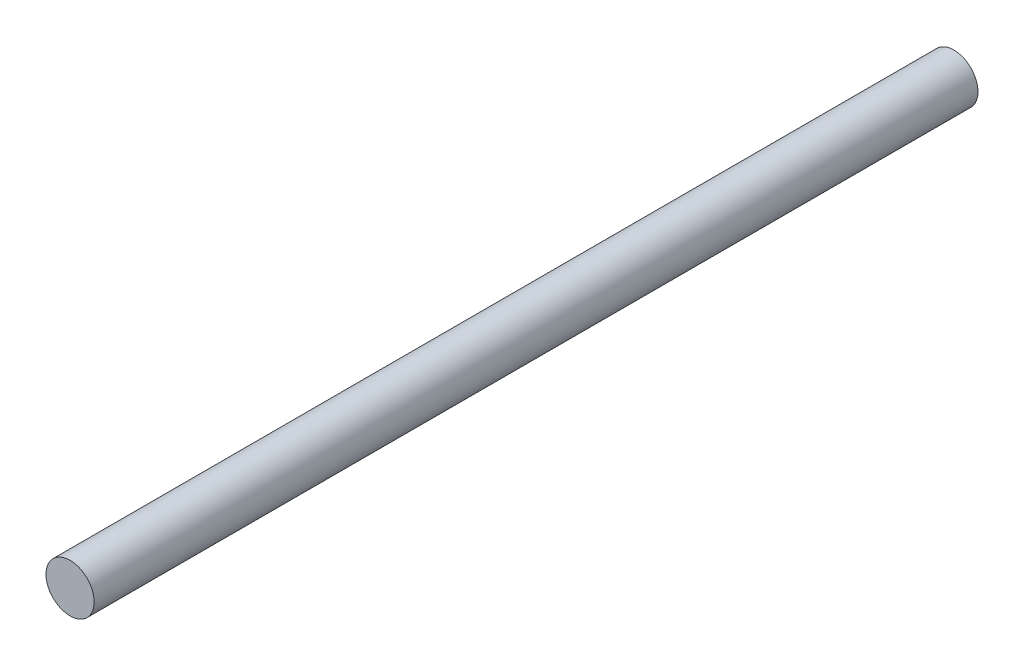
ISO-10303-21;
HEADER;
FILE_DESCRIPTION(('STEP AP214'),'2;1');
FILE_NAME('part.step','',(''),(''),'','','');
FILE_SCHEMA(('AUTOMOTIVE_DESIGN { 1 0 10303 214 1 1 1 1 }'));
ENDSEC;
DATA;
#1=APPLICATION_CONTEXT('core data for automotive mechanical design processes');
#2=APPLICATION_PROTOCOL_DEFINITION('international standard','automotive_design',2000,#1);
#3=PRODUCT_CONTEXT('',#1,'mechanical');
#4=PRODUCT('Part','Part','',(#3));
#5=PRODUCT_RELATED_PRODUCT_CATEGORY('part','',(#4));
#6=PRODUCT_DEFINITION_FORMATION('','',#4);
#7=PRODUCT_DEFINITION_CONTEXT('part definition',#1,'design');
#8=PRODUCT_DEFINITION('design','',#6,#7);
#9=PRODUCT_DEFINITION_SHAPE('','',#8);
#10=(LENGTH_UNIT() NAMED_UNIT(*) SI_UNIT(.MILLI.,.METRE.));
#11=(NAMED_UNIT(*) PLANE_ANGLE_UNIT() SI_UNIT($,.RADIAN.));
#12=(NAMED_UNIT(*) SI_UNIT($,.STERADIAN.) SOLID_ANGLE_UNIT());
#13=UNCERTAINTY_MEASURE_WITH_UNIT(LENGTH_MEASURE(1.E-05),#10,'distance_accuracy_value','');
#14=(GEOMETRIC_REPRESENTATION_CONTEXT(3) GLOBAL_UNCERTAINTY_ASSIGNED_CONTEXT((#13)) GLOBAL_UNIT_ASSIGNED_CONTEXT((#10,
#11,#12)) REPRESENTATION_CONTEXT('',''));
#15=CARTESIAN_POINT('',(0.,0.,0.));
#16=DIRECTION('',(0.,0.,1.));
#17=DIRECTION('',(1.,0.,0.));
#18=AXIS2_PLACEMENT_3D('',#15,#16,#17);
#19=CARTESIAN_POINT('',(0.,0.,110.));
#20=DIRECTION('',(0.,0.,-1.));
#21=DIRECTION('',(-1.,0.,0.));
#22=AXIS2_PLACEMENT_3D('',#19,#20,#21);
#23=CYLINDRICAL_SURFACE('',#22,3.);
#24=CARTESIAN_POINT('',(0.,0.,110.));
#25=DIRECTION('',(0.,0.,1.));
#26=DIRECTION('',(1.,0.,0.));
#27=AXIS2_PLACEMENT_3D('',#24,#25,#26);
#28=CIRCLE('',#27,3.);
#29=CARTESIAN_POINT('',(3.,0.,110.));
#30=VERTEX_POINT('',#29);
#31=EDGE_CURVE('E10',#30,#30,#28,.T.);
#32=ORIENTED_EDGE('',*,*,#31,.F.);
#33=EDGE_LOOP('',(#32));
#34=FACE_BOUND('',#33,.T.);
#35=CARTESIAN_POINT('',(0.,0.,0.));
#36=DIRECTION('',(0.,0.,1.));
#37=DIRECTION('',(1.,0.,0.));
#38=AXIS2_PLACEMENT_3D('',#35,#36,#37);
#39=CIRCLE('',#38,3.);
#40=CARTESIAN_POINT('',(3.,0.,0.));
#41=VERTEX_POINT('',#40);
#42=EDGE_CURVE('E40',#41,#41,#39,.T.);
#43=ORIENTED_EDGE('',*,*,#42,.T.);
#44=EDGE_LOOP('',(#43));
#45=FACE_BOUND('',#44,.T.);
#46=ADVANCED_FACE('F37',(#34,#45),#23,.T.);
#47=CARTESIAN_POINT('',(0.,0.,110.));
#48=DIRECTION('',(0.,0.,1.));
#49=DIRECTION('',(1.,0.,0.));
#50=AXIS2_PLACEMENT_3D('',#47,#48,#49);
#51=PLANE('',#50);
#52=ORIENTED_EDGE('',*,*,#31,.T.);
#53=EDGE_LOOP('',(#52));
#54=FACE_BOUND('',#53,.T.);
#55=ADVANCED_FACE('F54',(#54),#51,.T.);
#56=CARTESIAN_POINT('',(0.,0.,0.));
#57=DIRECTION('',(0.,0.,1.));
#58=DIRECTION('',(1.,0.,0.));
#59=AXIS2_PLACEMENT_3D('',#56,#57,#58);
#60=PLANE('',#59);
#61=ORIENTED_EDGE('',*,*,#42,.F.);
#62=EDGE_LOOP('',(#61));
#63=FACE_BOUND('',#62,.T.);
#64=ADVANCED_FACE('F52',(#63),#60,.F.);
#65=CLOSED_SHELL('',(#46,#55,#64));
#66=MANIFOLD_SOLID_BREP('B2',#65);
#67=ADVANCED_BREP_SHAPE_REPRESENTATION('',(#18,#66),#14);
#68=SHAPE_DEFINITION_REPRESENTATION(#9,#67);
ENDSEC;
END-ISO-10303-21;
